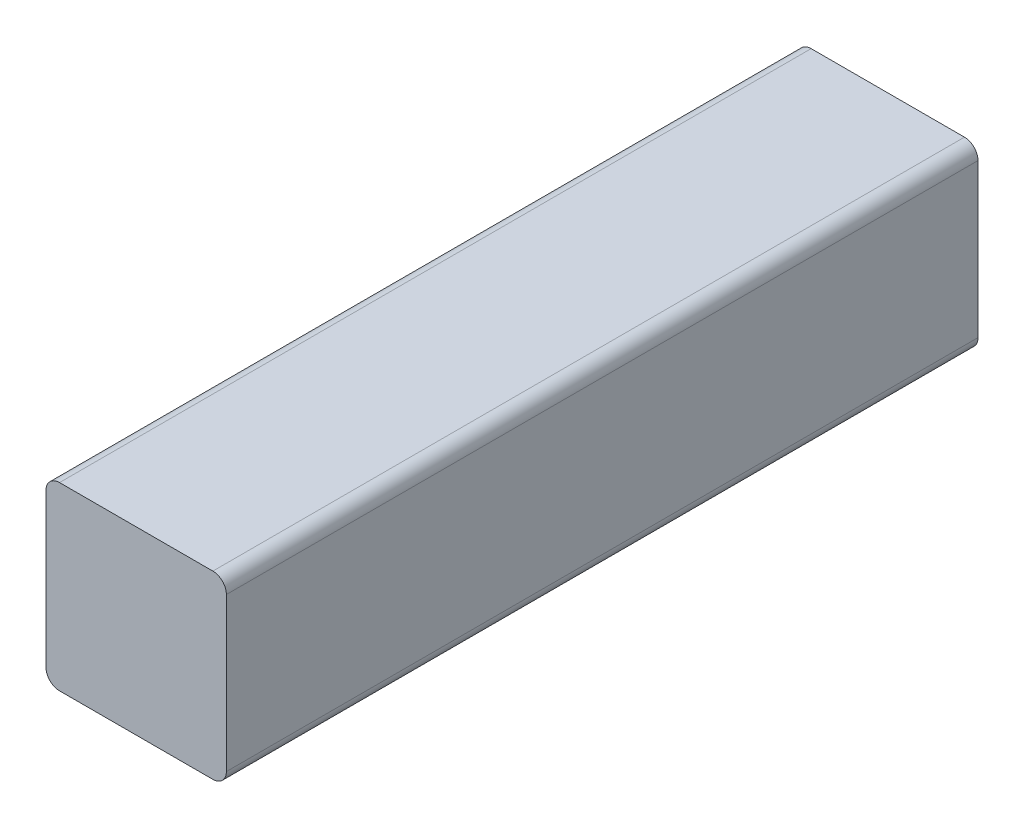
ISO-10303-21;
HEADER;
FILE_DESCRIPTION(('STEP AP214'),'2;1');
FILE_NAME('part.step','',(''),(''),'','','');
FILE_SCHEMA(('AUTOMOTIVE_DESIGN { 1 0 10303 214 1 1 1 1 }'));
ENDSEC;
DATA;
#1=APPLICATION_CONTEXT('core data for automotive mechanical design processes');
#2=APPLICATION_PROTOCOL_DEFINITION('international standard','automotive_design',2000,#1);
#3=PRODUCT_CONTEXT('',#1,'mechanical');
#4=PRODUCT('Part','Part','',(#3));
#5=PRODUCT_RELATED_PRODUCT_CATEGORY('part','',(#4));
#6=PRODUCT_DEFINITION_FORMATION('','',#4);
#7=PRODUCT_DEFINITION_CONTEXT('part definition',#1,'design');
#8=PRODUCT_DEFINITION('design','',#6,#7);
#9=PRODUCT_DEFINITION_SHAPE('','',#8);
#10=(LENGTH_UNIT() NAMED_UNIT(*) SI_UNIT(.MILLI.,.METRE.));
#11=(NAMED_UNIT(*) PLANE_ANGLE_UNIT() SI_UNIT($,.RADIAN.));
#12=(NAMED_UNIT(*) SI_UNIT($,.STERADIAN.) SOLID_ANGLE_UNIT());
#13=UNCERTAINTY_MEASURE_WITH_UNIT(LENGTH_MEASURE(1.E-05),#10,'distance_accuracy_value','');
#14=(GEOMETRIC_REPRESENTATION_CONTEXT(3) GLOBAL_UNCERTAINTY_ASSIGNED_CONTEXT((#13)) GLOBAL_UNIT_ASSIGNED_CONTEXT((#10,
#11,#12)) REPRESENTATION_CONTEXT('',''));
#15=CARTESIAN_POINT('',(0.,0.,0.));
#16=DIRECTION('',(0.,0.,1.));
#17=DIRECTION('',(1.,0.,0.));
#18=AXIS2_PLACEMENT_3D('',#15,#16,#17);
#19=CARTESIAN_POINT('',(12.75,12.75,125.));
#20=DIRECTION('',(0.,0.,-1.));
#21=DIRECTION('',(-1.,0.,0.));
#22=AXIS2_PLACEMENT_3D('',#19,#20,#21);
#23=CYLINDRICAL_SURFACE('',#22,2.25);
#24=CARTESIAN_POINT('',(12.75,12.75,0.));
#25=DIRECTION('',(0.,0.,1.));
#26=DIRECTION('',(-1.,0.,0.));
#27=AXIS2_PLACEMENT_3D('',#24,#25,#26);
#28=CIRCLE('',#27,2.25);
#29=CARTESIAN_POINT('',(15.,12.75,0.));
#30=VERTEX_POINT('',#29);
#31=CARTESIAN_POINT('',(12.75,15.,0.));
#32=VERTEX_POINT('',#31);
#33=EDGE_CURVE('E101',#30,#32,#28,.T.);
#34=ORIENTED_EDGE('',*,*,#33,.T.);
#35=DIRECTION('',(0.,0.,-1.));
#36=VECTOR('',#35,1.);
#37=CARTESIAN_POINT('',(12.75,15.,125.));
#38=LINE('',#37,#36);
#39=CARTESIAN_POINT('',(12.75,15.,125.));
#40=VERTEX_POINT('',#39);
#41=EDGE_CURVE('E11',#40,#32,#38,.T.);
#42=ORIENTED_EDGE('',*,*,#41,.F.);
#43=CARTESIAN_POINT('',(12.75,12.75,125.));
#44=DIRECTION('',(0.,0.,1.));
#45=DIRECTION('',(-1.,0.,0.));
#46=AXIS2_PLACEMENT_3D('',#43,#44,#45);
#47=CIRCLE('',#46,2.25);
#48=CARTESIAN_POINT('',(15.,12.75,125.));
#49=VERTEX_POINT('',#48);
#50=EDGE_CURVE('E128',#49,#40,#47,.T.);
#51=ORIENTED_EDGE('',*,*,#50,.F.);
#52=DIRECTION('',(0.,0.,-1.));
#53=VECTOR('',#52,1.);
#54=CARTESIAN_POINT('',(15.,12.75,125.));
#55=LINE('',#54,#53);
#56=EDGE_CURVE('E114',#49,#30,#55,.T.);
#57=ORIENTED_EDGE('',*,*,#56,.T.);
#58=EDGE_LOOP('',(#34,#42,#51,#57));
#59=FACE_BOUND('',#58,.T.);
#60=ADVANCED_FACE('F33',(#59),#23,.T.);
#61=CARTESIAN_POINT('',(-12.75,15.,125.));
#62=DIRECTION('',(0.,-1.,0.));
#63=DIRECTION('',(0.,0.,-1.));
#64=AXIS2_PLACEMENT_3D('',#61,#62,#63);
#65=PLANE('',#64);
#66=DIRECTION('',(-1.,0.,0.));
#67=VECTOR('',#66,1.);
#68=CARTESIAN_POINT('',(-12.75,15.,0.));
#69=LINE('',#68,#67);
#70=CARTESIAN_POINT('',(-12.75,15.,0.));
#71=VERTEX_POINT('',#70);
#72=EDGE_CURVE('E97',#32,#71,#69,.T.);
#73=ORIENTED_EDGE('',*,*,#72,.T.);
#74=DIRECTION('',(0.,0.,-1.));
#75=VECTOR('',#74,1.);
#76=CARTESIAN_POINT('',(-12.75,15.,125.));
#77=LINE('',#76,#75);
#78=CARTESIAN_POINT('',(-12.75,15.,125.));
#79=VERTEX_POINT('',#78);
#80=EDGE_CURVE('E40',#79,#71,#77,.T.);
#81=ORIENTED_EDGE('',*,*,#80,.F.);
#82=DIRECTION('',(-1.,0.,0.));
#83=VECTOR('',#82,1.);
#84=CARTESIAN_POINT('',(-12.75,15.,125.));
#85=LINE('',#84,#83);
#86=EDGE_CURVE('E110',#40,#79,#85,.T.);
#87=ORIENTED_EDGE('',*,*,#86,.F.);
#88=ORIENTED_EDGE('',*,*,#41,.T.);
#89=EDGE_LOOP('',(#73,#81,#87,#88));
#90=FACE_BOUND('',#89,.T.);
#91=ADVANCED_FACE('F109',(#90),#65,.F.);
#92=CARTESIAN_POINT('',(-12.75,12.75,125.));
#93=DIRECTION('',(0.,0.,-1.));
#94=DIRECTION('',(-1.,0.,0.));
#95=AXIS2_PLACEMENT_3D('',#92,#93,#94);
#96=CYLINDRICAL_SURFACE('',#95,2.25);
#97=CARTESIAN_POINT('',(-12.75,12.75,0.));
#98=DIRECTION('',(0.,0.,1.));
#99=DIRECTION('',(1.,0.,0.));
#100=AXIS2_PLACEMENT_3D('',#97,#98,#99);
#101=CIRCLE('',#100,2.25);
#102=CARTESIAN_POINT('',(-15.,12.75,0.));
#103=VERTEX_POINT('',#102);
#104=EDGE_CURVE('E103',#71,#103,#101,.T.);
#105=ORIENTED_EDGE('',*,*,#104,.T.);
#106=DIRECTION('',(0.,0.,-1.));
#107=VECTOR('',#106,1.);
#108=CARTESIAN_POINT('',(-15.,12.75,125.));
#109=LINE('',#108,#107);
#110=CARTESIAN_POINT('',(-15.,12.75,125.));
#111=VERTEX_POINT('',#110);
#112=EDGE_CURVE('E154',#111,#103,#109,.T.);
#113=ORIENTED_EDGE('',*,*,#112,.F.);
#114=CARTESIAN_POINT('',(-12.75,12.75,125.));
#115=DIRECTION('',(0.,0.,1.));
#116=DIRECTION('',(1.,0.,0.));
#117=AXIS2_PLACEMENT_3D('',#114,#115,#116);
#118=CIRCLE('',#117,2.25);
#119=EDGE_CURVE('E131',#79,#111,#118,.T.);
#120=ORIENTED_EDGE('',*,*,#119,.F.);
#121=ORIENTED_EDGE('',*,*,#80,.T.);
#122=EDGE_LOOP('',(#105,#113,#120,#121));
#123=FACE_BOUND('',#122,.T.);
#124=ADVANCED_FACE('F158',(#123),#96,.T.);
#125=CARTESIAN_POINT('',(-15.,12.75,125.));
#126=DIRECTION('',(1.,0.,0.));
#127=DIRECTION('',(0.,0.,-1.));
#128=AXIS2_PLACEMENT_3D('',#125,#126,#127);
#129=PLANE('',#128);
#130=DIRECTION('',(0.,-1.,0.));
#131=VECTOR('',#130,1.);
#132=CARTESIAN_POINT('',(-15.,12.75,0.));
#133=LINE('',#132,#131);
#134=CARTESIAN_POINT('',(-15.,-12.75,0.));
#135=VERTEX_POINT('',#134);
#136=EDGE_CURVE('E118',#103,#135,#133,.T.);
#137=ORIENTED_EDGE('',*,*,#136,.T.);
#138=DIRECTION('',(0.,0.,-1.));
#139=VECTOR('',#138,1.);
#140=CARTESIAN_POINT('',(-15.,-12.75,125.));
#141=LINE('',#140,#139);
#142=CARTESIAN_POINT('',(-15.,-12.75,125.));
#143=VERTEX_POINT('',#142);
#144=EDGE_CURVE('E151',#143,#135,#141,.T.);
#145=ORIENTED_EDGE('',*,*,#144,.F.);
#146=DIRECTION('',(0.,-1.,0.));
#147=VECTOR('',#146,1.);
#148=CARTESIAN_POINT('',(-15.,12.75,125.));
#149=LINE('',#148,#147);
#150=EDGE_CURVE('E133',#111,#143,#149,.T.);
#151=ORIENTED_EDGE('',*,*,#150,.F.);
#152=ORIENTED_EDGE('',*,*,#112,.T.);
#153=EDGE_LOOP('',(#137,#145,#151,#152));
#154=FACE_BOUND('',#153,.T.);
#155=ADVANCED_FACE('F166',(#154),#129,.F.);
#156=CARTESIAN_POINT('',(-12.75,-12.75,125.));
#157=DIRECTION('',(0.,0.,-1.));
#158=DIRECTION('',(-1.,0.,0.));
#159=AXIS2_PLACEMENT_3D('',#156,#157,#158);
#160=CYLINDRICAL_SURFACE('',#159,2.25);
#161=CARTESIAN_POINT('',(-12.75,-12.75,0.));
#162=DIRECTION('',(0.,0.,1.));
#163=DIRECTION('',(-1.,0.,0.));
#164=AXIS2_PLACEMENT_3D('',#161,#162,#163);
#165=CIRCLE('',#164,2.25);
#166=CARTESIAN_POINT('',(-12.75,-15.,0.));
#167=VERTEX_POINT('',#166);
#168=EDGE_CURVE('E120',#135,#167,#165,.T.);
#169=ORIENTED_EDGE('',*,*,#168,.T.);
#170=DIRECTION('',(0.,0.,-1.));
#171=VECTOR('',#170,1.);
#172=CARTESIAN_POINT('',(-12.75,-15.,125.));
#173=LINE('',#172,#171);
#174=CARTESIAN_POINT('',(-12.75,-15.,125.));
#175=VERTEX_POINT('',#174);
#176=EDGE_CURVE('E148',#175,#167,#173,.T.);
#177=ORIENTED_EDGE('',*,*,#176,.F.);
#178=CARTESIAN_POINT('',(-12.75,-12.75,125.));
#179=DIRECTION('',(0.,0.,1.));
#180=DIRECTION('',(-1.,0.,0.));
#181=AXIS2_PLACEMENT_3D('',#178,#179,#180);
#182=CIRCLE('',#181,2.25);
#183=EDGE_CURVE('E135',#143,#175,#182,.T.);
#184=ORIENTED_EDGE('',*,*,#183,.F.);
#185=ORIENTED_EDGE('',*,*,#144,.T.);
#186=EDGE_LOOP('',(#169,#177,#184,#185));
#187=FACE_BOUND('',#186,.T.);
#188=ADVANCED_FACE('F169',(#187),#160,.T.);
#189=CARTESIAN_POINT('',(-12.75,-15.,125.));
#190=DIRECTION('',(0.,1.,0.));
#191=DIRECTION('',(0.,0.,1.));
#192=AXIS2_PLACEMENT_3D('',#189,#190,#191);
#193=PLANE('',#192);
#194=DIRECTION('',(1.,0.,0.));
#195=VECTOR('',#194,1.);
#196=CARTESIAN_POINT('',(-12.75,-15.,0.));
#197=LINE('',#196,#195);
#198=CARTESIAN_POINT('',(12.75,-15.,0.));
#199=VERTEX_POINT('',#198);
#200=EDGE_CURVE('E122',#167,#199,#197,.T.);
#201=ORIENTED_EDGE('',*,*,#200,.T.);
#202=DIRECTION('',(0.,0.,-1.));
#203=VECTOR('',#202,1.);
#204=CARTESIAN_POINT('',(12.75,-15.,125.));
#205=LINE('',#204,#203);
#206=CARTESIAN_POINT('',(12.75,-15.,125.));
#207=VERTEX_POINT('',#206);
#208=EDGE_CURVE('E145',#207,#199,#205,.T.);
#209=ORIENTED_EDGE('',*,*,#208,.F.);
#210=DIRECTION('',(1.,0.,0.));
#211=VECTOR('',#210,1.);
#212=CARTESIAN_POINT('',(-12.75,-15.,125.));
#213=LINE('',#212,#211);
#214=EDGE_CURVE('E137',#175,#207,#213,.T.);
#215=ORIENTED_EDGE('',*,*,#214,.F.);
#216=ORIENTED_EDGE('',*,*,#176,.T.);
#217=EDGE_LOOP('',(#201,#209,#215,#216));
#218=FACE_BOUND('',#217,.T.);
#219=ADVANCED_FACE('F174',(#218),#193,.F.);
#220=CARTESIAN_POINT('',(12.75,-12.75,125.));
#221=DIRECTION('',(0.,0.,-1.));
#222=DIRECTION('',(-1.,0.,0.));
#223=AXIS2_PLACEMENT_3D('',#220,#221,#222);
#224=CYLINDRICAL_SURFACE('',#223,2.25);
#225=CARTESIAN_POINT('',(12.75,-12.75,0.));
#226=DIRECTION('',(0.,0.,1.));
#227=DIRECTION('',(1.,0.,0.));
#228=AXIS2_PLACEMENT_3D('',#225,#226,#227);
#229=CIRCLE('',#228,2.25);
#230=CARTESIAN_POINT('',(15.,-12.75,0.));
#231=VERTEX_POINT('',#230);
#232=EDGE_CURVE('E124',#199,#231,#229,.T.);
#233=ORIENTED_EDGE('',*,*,#232,.T.);
#234=DIRECTION('',(0.,0.,-1.));
#235=VECTOR('',#234,1.);
#236=CARTESIAN_POINT('',(15.,-12.75,125.));
#237=LINE('',#236,#235);
#238=CARTESIAN_POINT('',(15.,-12.75,125.));
#239=VERTEX_POINT('',#238);
#240=EDGE_CURVE('E142',#239,#231,#237,.T.);
#241=ORIENTED_EDGE('',*,*,#240,.F.);
#242=CARTESIAN_POINT('',(12.75,-12.75,125.));
#243=DIRECTION('',(0.,0.,1.));
#244=DIRECTION('',(1.,0.,0.));
#245=AXIS2_PLACEMENT_3D('',#242,#243,#244);
#246=CIRCLE('',#245,2.25);
#247=EDGE_CURVE('E52',#207,#239,#246,.T.);
#248=ORIENTED_EDGE('',*,*,#247,.F.);
#249=ORIENTED_EDGE('',*,*,#208,.T.);
#250=EDGE_LOOP('',(#233,#241,#248,#249));
#251=FACE_BOUND('',#250,.T.);
#252=ADVANCED_FACE('F177',(#251),#224,.T.);
#253=CARTESIAN_POINT('',(15.,12.75,125.));
#254=DIRECTION('',(-1.,0.,0.));
#255=DIRECTION('',(0.,0.,1.));
#256=AXIS2_PLACEMENT_3D('',#253,#254,#255);
#257=PLANE('',#256);
#258=DIRECTION('',(0.,1.,0.));
#259=VECTOR('',#258,1.);
#260=CARTESIAN_POINT('',(15.,12.75,0.));
#261=LINE('',#260,#259);
#262=EDGE_CURVE('E126',#231,#30,#261,.T.);
#263=ORIENTED_EDGE('',*,*,#262,.T.);
#264=ORIENTED_EDGE('',*,*,#56,.F.);
#265=DIRECTION('',(0.,1.,0.));
#266=VECTOR('',#265,1.);
#267=CARTESIAN_POINT('',(15.,12.75,125.));
#268=LINE('',#267,#266);
#269=EDGE_CURVE('E47',#239,#49,#268,.T.);
#270=ORIENTED_EDGE('',*,*,#269,.F.);
#271=ORIENTED_EDGE('',*,*,#240,.T.);
#272=EDGE_LOOP('',(#263,#264,#270,#271));
#273=FACE_BOUND('',#272,.T.);
#274=ADVANCED_FACE('F179',(#273),#257,.F.);
#275=CARTESIAN_POINT('',(12.75,12.75,125.));
#276=DIRECTION('',(0.,0.,-1.));
#277=DIRECTION('',(-1.,0.,0.));
#278=AXIS2_PLACEMENT_3D('',#275,#276,#277);
#279=PLANE('',#278);
#280=ORIENTED_EDGE('',*,*,#50,.T.);
#281=ORIENTED_EDGE('',*,*,#86,.T.);
#282=ORIENTED_EDGE('',*,*,#119,.T.);
#283=ORIENTED_EDGE('',*,*,#150,.T.);
#284=ORIENTED_EDGE('',*,*,#183,.T.);
#285=ORIENTED_EDGE('',*,*,#214,.T.);
#286=ORIENTED_EDGE('',*,*,#247,.T.);
#287=ORIENTED_EDGE('',*,*,#269,.T.);
#288=EDGE_LOOP('',(#280,#281,#282,#283,#284,#285,#286,#287));
#289=FACE_BOUND('',#288,.T.);
#290=ADVANCED_FACE('F161',(#289),#279,.F.);
#291=CARTESIAN_POINT('',(12.75,12.75,0.));
#292=DIRECTION('',(0.,0.,-1.));
#293=DIRECTION('',(-1.,0.,0.));
#294=AXIS2_PLACEMENT_3D('',#291,#292,#293);
#295=PLANE('',#294);
#296=ORIENTED_EDGE('',*,*,#33,.F.);
#297=ORIENTED_EDGE('',*,*,#262,.F.);
#298=ORIENTED_EDGE('',*,*,#232,.F.);
#299=ORIENTED_EDGE('',*,*,#200,.F.);
#300=ORIENTED_EDGE('',*,*,#168,.F.);
#301=ORIENTED_EDGE('',*,*,#136,.F.);
#302=ORIENTED_EDGE('',*,*,#104,.F.);
#303=ORIENTED_EDGE('',*,*,#72,.F.);
#304=EDGE_LOOP('',(#296,#297,#298,#299,#300,#301,#302,#303));
#305=FACE_BOUND('',#304,.T.);
#306=ADVANCED_FACE('F98',(#305),#295,.T.);
#307=CLOSED_SHELL('',(#60,#91,#124,#155,#188,#219,#252,#274,#290,#306));
#308=MANIFOLD_SOLID_BREP('B2',#307);
#309=ADVANCED_BREP_SHAPE_REPRESENTATION('',(#18,#308),#14);
#310=SHAPE_DEFINITION_REPRESENTATION(#9,#309);
ENDSEC;
END-ISO-10303-21;
